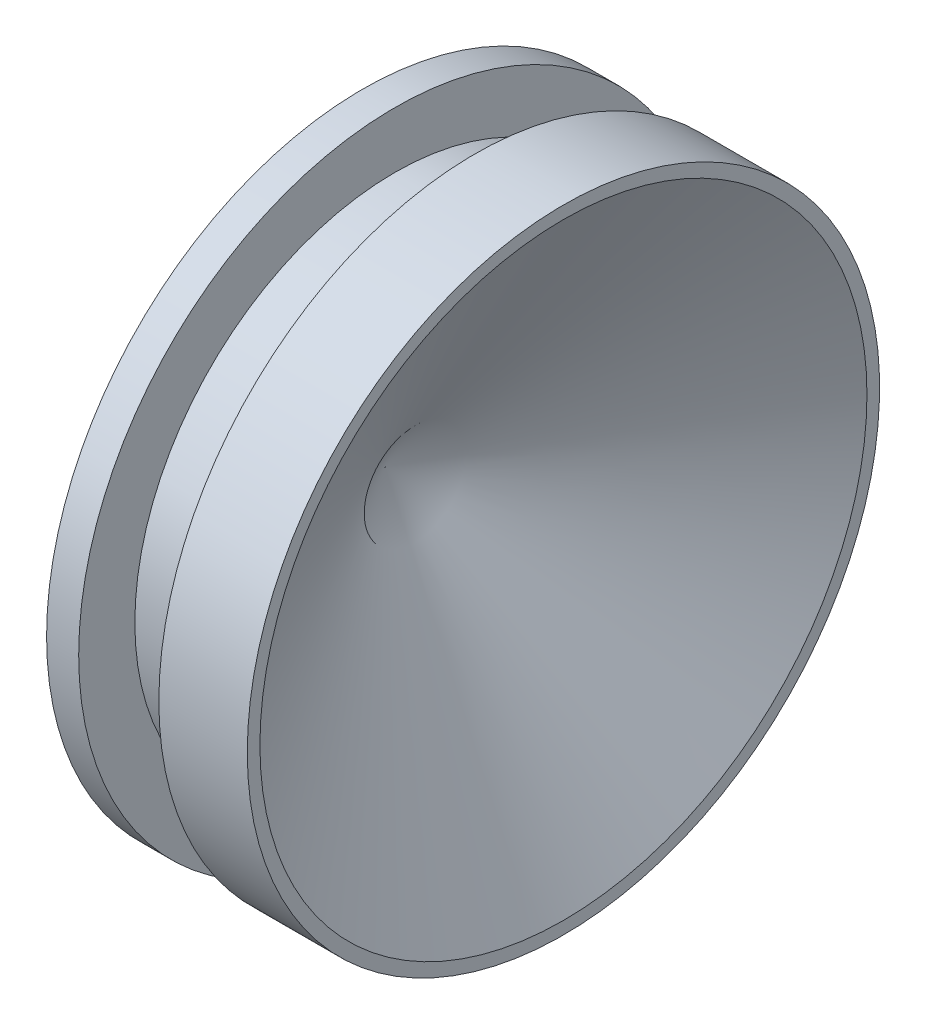
ISO-10303-21;
HEADER;
FILE_DESCRIPTION(('STEP AP214'),'2;1');
FILE_NAME('part.step','',(''),(''),'','','');
FILE_SCHEMA(('AUTOMOTIVE_DESIGN { 1 0 10303 214 1 1 1 1 }'));
ENDSEC;
DATA;
#1=APPLICATION_CONTEXT('core data for automotive mechanical design processes');
#2=APPLICATION_PROTOCOL_DEFINITION('international standard','automotive_design',2000,#1);
#3=PRODUCT_CONTEXT('',#1,'mechanical');
#4=PRODUCT('Part','Part','',(#3));
#5=PRODUCT_RELATED_PRODUCT_CATEGORY('part','',(#4));
#6=PRODUCT_DEFINITION_FORMATION('','',#4);
#7=PRODUCT_DEFINITION_CONTEXT('part definition',#1,'design');
#8=PRODUCT_DEFINITION('design','',#6,#7);
#9=PRODUCT_DEFINITION_SHAPE('','',#8);
#10=(LENGTH_UNIT() NAMED_UNIT(*) SI_UNIT(.MILLI.,.METRE.));
#11=(NAMED_UNIT(*) PLANE_ANGLE_UNIT() SI_UNIT($,.RADIAN.));
#12=(NAMED_UNIT(*) SI_UNIT($,.STERADIAN.) SOLID_ANGLE_UNIT());
#13=UNCERTAINTY_MEASURE_WITH_UNIT(LENGTH_MEASURE(1.E-05),#10,'distance_accuracy_value','');
#14=(GEOMETRIC_REPRESENTATION_CONTEXT(3) GLOBAL_UNCERTAINTY_ASSIGNED_CONTEXT((#13)) GLOBAL_UNIT_ASSIGNED_CONTEXT((#10,
#11,#12)) REPRESENTATION_CONTEXT('',''));
#15=CARTESIAN_POINT('',(0.,0.,0.));
#16=DIRECTION('',(0.,0.,1.));
#17=DIRECTION('',(1.,0.,0.));
#18=AXIS2_PLACEMENT_3D('',#15,#16,#17);
#19=CARTESIAN_POINT('',(0.,0.,0.));
#20=DIRECTION('',(-1.,0.,0.));
#21=DIRECTION('',(0.,0.,1.));
#22=AXIS2_PLACEMENT_3D('',#19,#20,#21);
#23=PLANE('',#22);
#24=CARTESIAN_POINT('',(0.,0.,0.));
#25=DIRECTION('',(-1.,0.,0.));
#26=DIRECTION('',(0.,0.,1.));
#27=AXIS2_PLACEMENT_3D('',#24,#25,#26);
#28=CIRCLE('',#27,2.5019);
#29=CARTESIAN_POINT('',(0.,0.,2.5019));
#30=VERTEX_POINT('',#29);
#31=EDGE_CURVE('E11',#30,#30,#28,.T.);
#32=ORIENTED_EDGE('',*,*,#31,.T.);
#33=EDGE_LOOP('',(#32));
#34=FACE_BOUND('',#33,.T.);
#35=ADVANCED_FACE('F43',(#34),#23,.T.);
#36=CARTESIAN_POINT('',(0.,0.,0.));
#37=DIRECTION('',(-1.,0.,0.));
#38=DIRECTION('',(0.,0.,1.));
#39=AXIS2_PLACEMENT_3D('',#36,#37,#38);
#40=CYLINDRICAL_SURFACE('',#39,2.5019);
#41=CARTESIAN_POINT('',(0.254,0.,0.));
#42=DIRECTION('',(-1.,0.,0.));
#43=DIRECTION('',(0.,0.,1.));
#44=AXIS2_PLACEMENT_3D('',#41,#42,#43);
#45=CIRCLE('',#44,2.5019);
#46=CARTESIAN_POINT('',(0.254,0.,2.5019));
#47=VERTEX_POINT('',#46);
#48=EDGE_CURVE('E50',#47,#47,#45,.T.);
#49=ORIENTED_EDGE('',*,*,#48,.T.);
#50=EDGE_LOOP('',(#49));
#51=FACE_BOUND('',#50,.T.);
#52=ORIENTED_EDGE('',*,*,#31,.F.);
#53=EDGE_LOOP('',(#52));
#54=FACE_BOUND('',#53,.T.);
#55=ADVANCED_FACE('F84',(#51,#54),#40,.T.);
#56=CARTESIAN_POINT('',(0.254,-2.5019,0.));
#57=DIRECTION('',(1.,0.,0.));
#58=DIRECTION('',(0.,0.,-1.));
#59=AXIS2_PLACEMENT_3D('',#56,#57,#58);
#60=PLANE('',#59);
#61=CARTESIAN_POINT('',(0.254,0.,0.));
#62=DIRECTION('',(-1.,0.,0.));
#63=DIRECTION('',(0.,0.,1.));
#64=AXIS2_PLACEMENT_3D('',#61,#62,#63);
#65=CIRCLE('',#64,2.0574);
#66=CARTESIAN_POINT('',(0.254,0.,2.0574));
#67=VERTEX_POINT('',#66);
#68=EDGE_CURVE('E78',#67,#67,#65,.T.);
#69=ORIENTED_EDGE('',*,*,#68,.T.);
#70=EDGE_LOOP('',(#69));
#71=FACE_BOUND('',#70,.T.);
#72=ORIENTED_EDGE('',*,*,#48,.F.);
#73=EDGE_LOOP('',(#72));
#74=FACE_BOUND('',#73,.T.);
#75=ADVANCED_FACE('F87',(#71,#74),#60,.T.);
#76=CARTESIAN_POINT('',(0.,0.,0.));
#77=DIRECTION('',(-1.,0.,0.));
#78=DIRECTION('',(0.,0.,1.));
#79=AXIS2_PLACEMENT_3D('',#76,#77,#78);
#80=CYLINDRICAL_SURFACE('',#79,2.0574);
#81=CARTESIAN_POINT('',(0.889,0.,0.));
#82=DIRECTION('',(-1.,0.,0.));
#83=DIRECTION('',(0.,0.,1.));
#84=AXIS2_PLACEMENT_3D('',#81,#82,#83);
#85=CIRCLE('',#84,2.0574);
#86=CARTESIAN_POINT('',(0.889,0.,2.0574));
#87=VERTEX_POINT('',#86);
#88=EDGE_CURVE('E74',#87,#87,#85,.T.);
#89=ORIENTED_EDGE('',*,*,#88,.T.);
#90=EDGE_LOOP('',(#89));
#91=FACE_BOUND('',#90,.T.);
#92=ORIENTED_EDGE('',*,*,#68,.F.);
#93=EDGE_LOOP('',(#92));
#94=FACE_BOUND('',#93,.T.);
#95=ADVANCED_FACE('F89',(#91,#94),#80,.T.);
#96=CARTESIAN_POINT('',(0.889,-2.0574,0.));
#97=DIRECTION('',(-1.,0.,0.));
#98=DIRECTION('',(0.,0.,1.));
#99=AXIS2_PLACEMENT_3D('',#96,#97,#98);
#100=PLANE('',#99);
#101=CARTESIAN_POINT('',(0.889,0.,0.));
#102=DIRECTION('',(-1.,0.,0.));
#103=DIRECTION('',(0.,0.,1.));
#104=AXIS2_PLACEMENT_3D('',#101,#102,#103);
#105=CIRCLE('',#104,2.50238879832815);
#106=CARTESIAN_POINT('',(0.889,0.,2.50238879832815));
#107=VERTEX_POINT('',#106);
#108=EDGE_CURVE('E68',#107,#107,#105,.T.);
#109=ORIENTED_EDGE('',*,*,#108,.T.);
#110=EDGE_LOOP('',(#109));
#111=FACE_BOUND('',#110,.T.);
#112=ORIENTED_EDGE('',*,*,#88,.F.);
#113=EDGE_LOOP('',(#112));
#114=FACE_BOUND('',#113,.T.);
#115=ADVANCED_FACE('F96',(#111,#114),#100,.T.);
#116=CARTESIAN_POINT('',(0.,0.,0.));
#117=DIRECTION('',(-1.,0.,0.));
#118=DIRECTION('',(0.,0.,1.));
#119=AXIS2_PLACEMENT_3D('',#116,#117,#118);
#120=CYLINDRICAL_SURFACE('',#119,2.50238879832815);
#121=CARTESIAN_POINT('',(1.589,0.,0.));
#122=DIRECTION('',(-1.,0.,0.));
#123=DIRECTION('',(0.,0.,1.));
#124=AXIS2_PLACEMENT_3D('',#121,#122,#123);
#125=CIRCLE('',#124,2.50238879832815);
#126=CARTESIAN_POINT('',(1.589,0.,2.50238879832815));
#127=VERTEX_POINT('',#126);
#128=EDGE_CURVE('E63',#127,#127,#125,.T.);
#129=ORIENTED_EDGE('',*,*,#128,.T.);
#130=EDGE_LOOP('',(#129));
#131=FACE_BOUND('',#130,.T.);
#132=ORIENTED_EDGE('',*,*,#108,.F.);
#133=EDGE_LOOP('',(#132));
#134=FACE_BOUND('',#133,.T.);
#135=ADVANCED_FACE('F122',(#131,#134),#120,.T.);
#136=CARTESIAN_POINT('',(1.589,-2.50238879832815,0.));
#137=DIRECTION('',(1.,0.,0.));
#138=DIRECTION('',(0.,0.,-1.));
#139=AXIS2_PLACEMENT_3D('',#136,#137,#138);
#140=PLANE('',#139);
#141=CARTESIAN_POINT('',(1.589,0.,0.));
#142=DIRECTION('',(-1.,0.,0.));
#143=DIRECTION('',(0.,0.,1.));
#144=AXIS2_PLACEMENT_3D('',#141,#142,#143);
#145=CIRCLE('',#144,2.40238879832815);
#146=CARTESIAN_POINT('',(1.589,0.,2.40238879832815));
#147=VERTEX_POINT('',#146);
#148=EDGE_CURVE('E60',#147,#147,#145,.T.);
#149=ORIENTED_EDGE('',*,*,#148,.T.);
#150=EDGE_LOOP('',(#149));
#151=FACE_BOUND('',#150,.T.);
#152=ORIENTED_EDGE('',*,*,#128,.F.);
#153=EDGE_LOOP('',(#152));
#154=FACE_BOUND('',#153,.T.);
#155=ADVANCED_FACE('F56',(#151,#154),#140,.T.);
#156=CARTESIAN_POINT('',(1.589,0.,0.));
#157=DIRECTION('',(1.,0.,0.));
#158=DIRECTION('',(0.,0.,-1.));
#159=AXIS2_PLACEMENT_3D('',#156,#157,#158);
#160=CONICAL_SURFACE('',#159,2.40238879832815,1.03961976556897);
#161=CARTESIAN_POINT('',(0.1776,0.,0.));
#162=VERTEX_POINT('',#161);
#163=VERTEX_LOOP('',#162);
#164=FACE_BOUND('',#163,.T.);
#165=ORIENTED_EDGE('',*,*,#148,.F.);
#166=EDGE_LOOP('',(#165));
#167=FACE_BOUND('',#166,.T.);
#168=ADVANCED_FACE('F53',(#164,#167),#160,.F.);
#169=CLOSED_SHELL('',(#35,#55,#75,#95,#115,#135,#155,#168));
#170=MANIFOLD_SOLID_BREP('B2',#169);
#171=ADVANCED_BREP_SHAPE_REPRESENTATION('',(#18,#170),#14);
#172=SHAPE_DEFINITION_REPRESENTATION(#9,#171);
ENDSEC;
END-ISO-10303-21;
